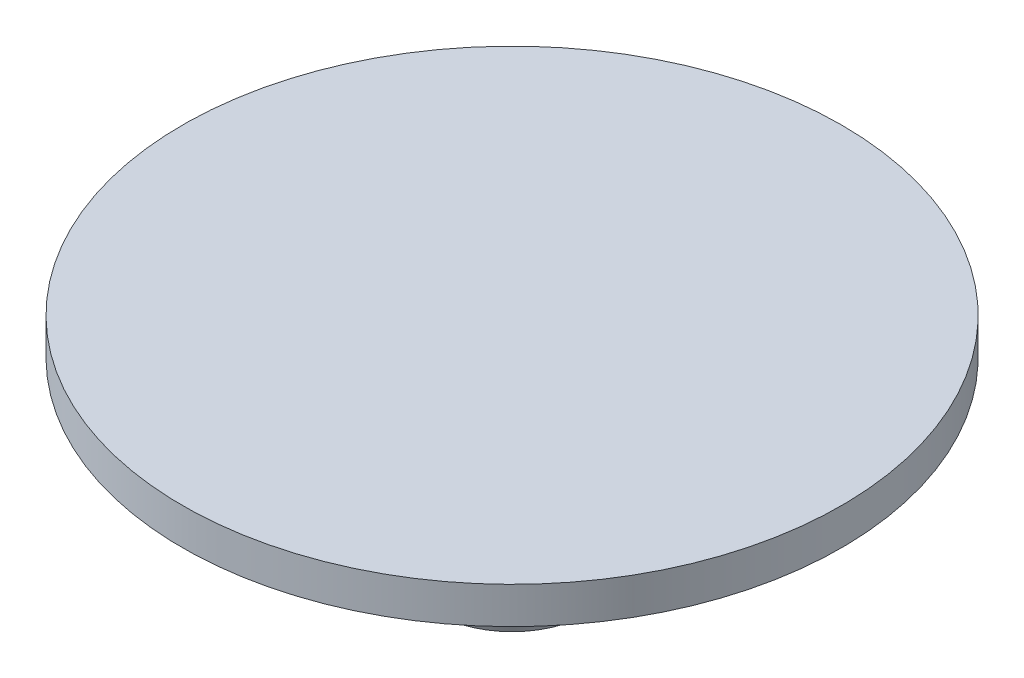
ISO-10303-21;
HEADER;
FILE_DESCRIPTION(('STEP AP214'),'2;1');
FILE_NAME('part.step','',(''),(''),'','','');
FILE_SCHEMA(('AUTOMOTIVE_DESIGN { 1 0 10303 214 1 1 1 1 }'));
ENDSEC;
DATA;
#1=APPLICATION_CONTEXT('core data for automotive mechanical design processes');
#2=APPLICATION_PROTOCOL_DEFINITION('international standard','automotive_design',2000,#1);
#3=PRODUCT_CONTEXT('',#1,'mechanical');
#4=PRODUCT('Part','Part','',(#3));
#5=PRODUCT_RELATED_PRODUCT_CATEGORY('part','',(#4));
#6=PRODUCT_DEFINITION_FORMATION('','',#4);
#7=PRODUCT_DEFINITION_CONTEXT('part definition',#1,'design');
#8=PRODUCT_DEFINITION('design','',#6,#7);
#9=PRODUCT_DEFINITION_SHAPE('','',#8);
#10=(LENGTH_UNIT() NAMED_UNIT(*) SI_UNIT(.MILLI.,.METRE.));
#11=(NAMED_UNIT(*) PLANE_ANGLE_UNIT() SI_UNIT($,.RADIAN.));
#12=(NAMED_UNIT(*) SI_UNIT($,.STERADIAN.) SOLID_ANGLE_UNIT());
#13=UNCERTAINTY_MEASURE_WITH_UNIT(LENGTH_MEASURE(1.E-05),#10,'distance_accuracy_value','');
#14=(GEOMETRIC_REPRESENTATION_CONTEXT(3) GLOBAL_UNCERTAINTY_ASSIGNED_CONTEXT((#13)) GLOBAL_UNIT_ASSIGNED_CONTEXT((#10,
#11,#12)) REPRESENTATION_CONTEXT('',''));
#15=CARTESIAN_POINT('',(0.,0.,0.));
#16=DIRECTION('',(0.,0.,1.));
#17=DIRECTION('',(1.,0.,0.));
#18=AXIS2_PLACEMENT_3D('',#15,#16,#17);
#19=CARTESIAN_POINT('',(-2.1,0.,0.));
#20=DIRECTION('',(0.,1.,0.));
#21=DIRECTION('',(0.,0.,1.));
#22=AXIS2_PLACEMENT_3D('',#19,#20,#21);
#23=PLANE('',#22);
#24=CARTESIAN_POINT('',(0.,0.,0.));
#25=DIRECTION('',(0.,-1.,0.));
#26=DIRECTION('',(0.,0.,-1.));
#27=AXIS2_PLACEMENT_3D('',#24,#25,#26);
#28=CIRCLE('',#27,2.1);
#29=CARTESIAN_POINT('',(0.,0.,-2.1));
#30=VERTEX_POINT('',#29);
#31=EDGE_CURVE('E53',#30,#30,#28,.T.);
#32=ORIENTED_EDGE('',*,*,#31,.T.);
#33=EDGE_LOOP('',(#32));
#34=FACE_BOUND('',#33,.T.);
#35=ADVANCED_FACE('F31',(#34),#23,.F.);
#36=CARTESIAN_POINT('',(-9.,6.,0.));
#37=DIRECTION('',(0.,-1.,0.));
#38=DIRECTION('',(0.,0.,-1.));
#39=AXIS2_PLACEMENT_3D('',#36,#37,#38);
#40=PLANE('',#39);
#41=CARTESIAN_POINT('',(0.,6.,0.));
#42=DIRECTION('',(0.,-1.,0.));
#43=DIRECTION('',(0.,0.,-1.));
#44=AXIS2_PLACEMENT_3D('',#41,#42,#43);
#45=CIRCLE('',#44,9.);
#46=CARTESIAN_POINT('',(0.,6.,-9.));
#47=VERTEX_POINT('',#46);
#48=EDGE_CURVE('E10',#47,#47,#45,.T.);
#49=ORIENTED_EDGE('',*,*,#48,.F.);
#50=EDGE_LOOP('',(#49));
#51=FACE_BOUND('',#50,.T.);
#52=ADVANCED_FACE('F83',(#51),#40,.F.);
#53=CARTESIAN_POINT('',(0.,0.,0.));
#54=DIRECTION('',(0.,-1.,0.));
#55=DIRECTION('',(0.,0.,-1.));
#56=AXIS2_PLACEMENT_3D('',#53,#54,#55);
#57=CYLINDRICAL_SURFACE('',#56,9.);
#58=CARTESIAN_POINT('',(0.,5.,0.));
#59=DIRECTION('',(0.,-1.,0.));
#60=DIRECTION('',(0.,0.,-1.));
#61=AXIS2_PLACEMENT_3D('',#58,#59,#60);
#62=CIRCLE('',#61,9.);
#63=CARTESIAN_POINT('',(0.,5.,-9.));
#64=VERTEX_POINT('',#63);
#65=EDGE_CURVE('E37',#64,#64,#62,.T.);
#66=ORIENTED_EDGE('',*,*,#65,.F.);
#67=EDGE_LOOP('',(#66));
#68=FACE_BOUND('',#67,.T.);
#69=ORIENTED_EDGE('',*,*,#48,.T.);
#70=EDGE_LOOP('',(#69));
#71=FACE_BOUND('',#70,.T.);
#72=ADVANCED_FACE('F78',(#68,#71),#57,.T.);
#73=CARTESIAN_POINT('',(-2.1,5.,0.));
#74=DIRECTION('',(0.,1.,0.));
#75=DIRECTION('',(0.,0.,1.));
#76=AXIS2_PLACEMENT_3D('',#73,#74,#75);
#77=PLANE('',#76);
#78=CARTESIAN_POINT('',(0.,5.,0.));
#79=DIRECTION('',(0.,-1.,0.));
#80=DIRECTION('',(0.,0.,-1.));
#81=AXIS2_PLACEMENT_3D('',#78,#79,#80);
#82=CIRCLE('',#81,2.1);
#83=CARTESIAN_POINT('',(0.,5.,-2.1));
#84=VERTEX_POINT('',#83);
#85=EDGE_CURVE('E41',#84,#84,#82,.T.);
#86=ORIENTED_EDGE('',*,*,#85,.F.);
#87=EDGE_LOOP('',(#86));
#88=FACE_BOUND('',#87,.T.);
#89=ORIENTED_EDGE('',*,*,#65,.T.);
#90=EDGE_LOOP('',(#89));
#91=FACE_BOUND('',#90,.T.);
#92=ADVANCED_FACE('F73',(#88,#91),#77,.F.);
#93=CARTESIAN_POINT('',(0.,0.,0.));
#94=DIRECTION('',(0.,-1.,0.));
#95=DIRECTION('',(0.,0.,-1.));
#96=AXIS2_PLACEMENT_3D('',#93,#94,#95);
#97=CYLINDRICAL_SURFACE('',#96,2.1);
#98=CARTESIAN_POINT('',(0.,3.,0.));
#99=DIRECTION('',(0.,-1.,0.));
#100=DIRECTION('',(0.,0.,-1.));
#101=AXIS2_PLACEMENT_3D('',#98,#99,#100);
#102=CIRCLE('',#101,2.1);
#103=CARTESIAN_POINT('',(0.,3.,-2.1));
#104=VERTEX_POINT('',#103);
#105=EDGE_CURVE('E45',#104,#104,#102,.T.);
#106=ORIENTED_EDGE('',*,*,#105,.F.);
#107=EDGE_LOOP('',(#106));
#108=FACE_BOUND('',#107,.T.);
#109=ORIENTED_EDGE('',*,*,#85,.T.);
#110=EDGE_LOOP('',(#109));
#111=FACE_BOUND('',#110,.T.);
#112=ADVANCED_FACE('F67',(#108,#111),#97,.T.);
#113=CARTESIAN_POINT('',(-3.,3.,0.));
#114=DIRECTION('',(0.,-1.,0.));
#115=DIRECTION('',(0.,0.,-1.));
#116=AXIS2_PLACEMENT_3D('',#113,#114,#115);
#117=PLANE('',#116);
#118=CARTESIAN_POINT('',(0.,3.,0.));
#119=DIRECTION('',(0.,-1.,0.));
#120=DIRECTION('',(0.,0.,-1.));
#121=AXIS2_PLACEMENT_3D('',#118,#119,#120);
#122=CIRCLE('',#121,3.);
#123=CARTESIAN_POINT('',(0.,3.,-3.));
#124=VERTEX_POINT('',#123);
#125=EDGE_CURVE('E50',#124,#124,#122,.T.);
#126=ORIENTED_EDGE('',*,*,#125,.F.);
#127=EDGE_LOOP('',(#126));
#128=FACE_BOUND('',#127,.T.);
#129=ORIENTED_EDGE('',*,*,#105,.T.);
#130=EDGE_LOOP('',(#129));
#131=FACE_BOUND('',#130,.T.);
#132=ADVANCED_FACE('F61',(#128,#131),#117,.F.);
#133=CARTESIAN_POINT('',(0.,3.,0.));
#134=DIRECTION('',(0.,1.,0.));
#135=DIRECTION('',(0.,0.,1.));
#136=AXIS2_PLACEMENT_3D('',#133,#134,#135);
#137=CONICAL_SURFACE('',#136,3.,0.291456794477866);
#138=ORIENTED_EDGE('',*,*,#31,.F.);
#139=EDGE_LOOP('',(#138));
#140=FACE_BOUND('',#139,.T.);
#141=ORIENTED_EDGE('',*,*,#125,.T.);
#142=EDGE_LOOP('',(#141));
#143=FACE_BOUND('',#142,.T.);
#144=ADVANCED_FACE('F58',(#140,#143),#137,.T.);
#145=CLOSED_SHELL('',(#35,#52,#72,#92,#112,#132,#144));
#146=MANIFOLD_SOLID_BREP('B2',#145);
#147=ADVANCED_BREP_SHAPE_REPRESENTATION('',(#18,#146),#14);
#148=SHAPE_DEFINITION_REPRESENTATION(#9,#147);
ENDSEC;
END-ISO-10303-21;
